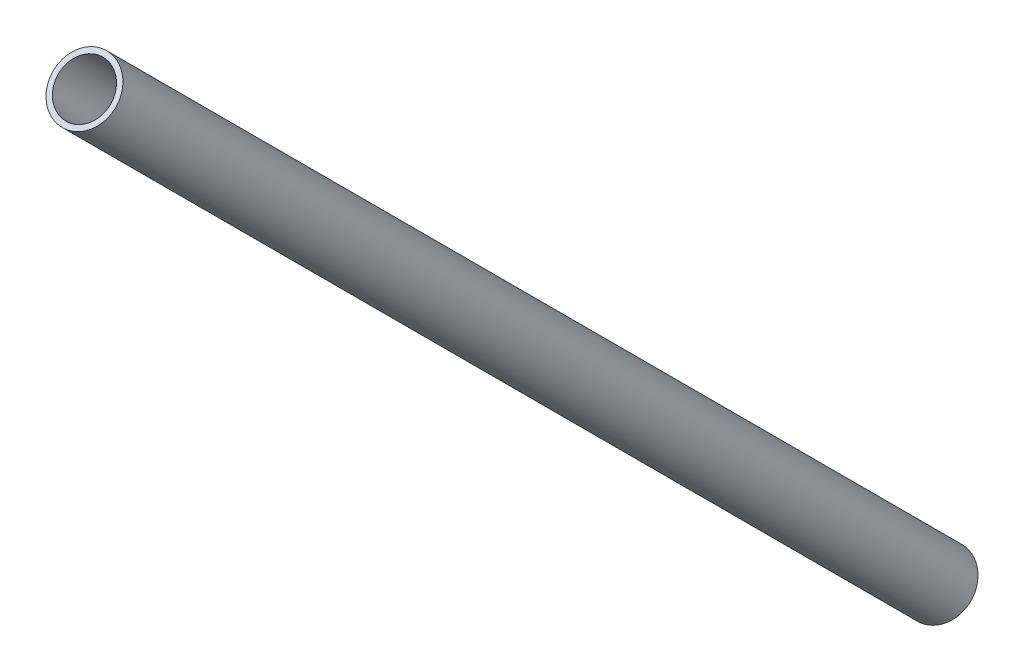
ISO-10303-21;
HEADER;
FILE_DESCRIPTION(('STEP AP214'),'2;1');
FILE_NAME('part.step','',(''),(''),'','','');
FILE_SCHEMA(('AUTOMOTIVE_DESIGN { 1 0 10303 214 1 1 1 1 }'));
ENDSEC;
DATA;
#1=APPLICATION_CONTEXT('core data for automotive mechanical design processes');
#2=APPLICATION_PROTOCOL_DEFINITION('international standard','automotive_design',2000,#1);
#3=PRODUCT_CONTEXT('',#1,'mechanical');
#4=PRODUCT('Part','Part','',(#3));
#5=PRODUCT_RELATED_PRODUCT_CATEGORY('part','',(#4));
#6=PRODUCT_DEFINITION_FORMATION('','',#4);
#7=PRODUCT_DEFINITION_CONTEXT('part definition',#1,'design');
#8=PRODUCT_DEFINITION('design','',#6,#7);
#9=PRODUCT_DEFINITION_SHAPE('','',#8);
#10=(LENGTH_UNIT() NAMED_UNIT(*) SI_UNIT(.MILLI.,.METRE.));
#11=(NAMED_UNIT(*) PLANE_ANGLE_UNIT() SI_UNIT($,.RADIAN.));
#12=(NAMED_UNIT(*) SI_UNIT($,.STERADIAN.) SOLID_ANGLE_UNIT());
#13=UNCERTAINTY_MEASURE_WITH_UNIT(LENGTH_MEASURE(1.E-05),#10,'distance_accuracy_value','');
#14=(GEOMETRIC_REPRESENTATION_CONTEXT(3) GLOBAL_UNCERTAINTY_ASSIGNED_CONTEXT((#13)) GLOBAL_UNIT_ASSIGNED_CONTEXT((#10,
#11,#12)) REPRESENTATION_CONTEXT('',''));
#15=CARTESIAN_POINT('',(0.,0.,0.));
#16=DIRECTION('',(0.,0.,1.));
#17=DIRECTION('',(1.,0.,0.));
#18=AXIS2_PLACEMENT_3D('',#15,#16,#17);
#19=CARTESIAN_POINT('',(0.,174.655374953078,166.170093578839));
#20=DIRECTION('',(0.,0.707106781186549,0.707106781186546));
#21=DIRECTION('',(0.,-0.707106781186546,0.707106781186549));
#22=AXIS2_PLACEMENT_3D('',#19,#20,#21);
#23=PLANE('',#22);
#24=CARTESIAN_POINT('',(0.,170.412734265958,170.412734265958));
#25=DIRECTION('',(0.,-0.707106781186549,-0.707106781186546));
#26=DIRECTION('',(0.,0.707106781186546,-0.707106781186549));
#27=AXIS2_PLACEMENT_3D('',#24,#25,#26);
#28=CIRCLE('',#27,5.00000000000002);
#29=CARTESIAN_POINT('',(0.,173.948268171891,166.877200360025));
#30=VERTEX_POINT('',#29);
#31=EDGE_CURVE('E10',#30,#30,#28,.T.);
#32=ORIENTED_EDGE('',*,*,#31,.T.);
#33=EDGE_LOOP('',(#32));
#34=FACE_BOUND('',#33,.T.);
#35=CARTESIAN_POINT('',(0.,170.412734265958,170.412734265958));
#36=DIRECTION('',(0.,-0.707106781186549,-0.707106781186546));
#37=DIRECTION('',(0.,0.707106781186546,-0.707106781186549));
#38=AXIS2_PLACEMENT_3D('',#35,#36,#37);
#39=CIRCLE('',#38,6.00000000000002);
#40=CARTESIAN_POINT('',(0.,174.655374953078,166.170093578839));
#41=VERTEX_POINT('',#40);
#42=EDGE_CURVE('E45',#41,#41,#39,.T.);
#43=ORIENTED_EDGE('',*,*,#42,.F.);
#44=EDGE_LOOP('',(#43));
#45=FACE_BOUND('',#44,.T.);
#46=ADVANCED_FACE('F31',(#34,#45),#23,.T.);
#47=CARTESIAN_POINT('',(0.,0.,0.));
#48=DIRECTION('',(0.,-0.707106781186549,-0.707106781186546));
#49=DIRECTION('',(0.,0.707106781186546,-0.707106781186549));
#50=AXIS2_PLACEMENT_3D('',#47,#48,#49);
#51=CYLINDRICAL_SURFACE('',#50,5.00000000000001);
#52=CARTESIAN_POINT('',(0.,7.07106781186547,7.07106781186544));
#53=DIRECTION('',(0.,-0.707106781186549,-0.707106781186546));
#54=DIRECTION('',(0.,0.707106781186546,-0.707106781186549));
#55=AXIS2_PLACEMENT_3D('',#52,#53,#54);
#56=CIRCLE('',#55,5.);
#57=CARTESIAN_POINT('',(0.,10.6066017177982,3.5355339059327));
#58=VERTEX_POINT('',#57);
#59=EDGE_CURVE('E37',#58,#58,#56,.T.);
#60=ORIENTED_EDGE('',*,*,#59,.T.);
#61=EDGE_LOOP('',(#60));
#62=FACE_BOUND('',#61,.T.);
#63=ORIENTED_EDGE('',*,*,#31,.F.);
#64=EDGE_LOOP('',(#63));
#65=FACE_BOUND('',#64,.T.);
#66=ADVANCED_FACE('F55',(#62,#65),#51,.F.);
#67=CARTESIAN_POINT('',(0.,11.3137084989848,2.82842712474616));
#68=DIRECTION('',(0.,-0.707106781186549,-0.707106781186546));
#69=DIRECTION('',(0.,0.707106781186546,-0.707106781186549));
#70=AXIS2_PLACEMENT_3D('',#67,#68,#69);
#71=PLANE('',#70);
#72=CARTESIAN_POINT('',(0.,7.07106781186549,7.07106781186546));
#73=DIRECTION('',(0.,-0.707106781186549,-0.707106781186546));
#74=DIRECTION('',(0.,0.707106781186546,-0.707106781186549));
#75=AXIS2_PLACEMENT_3D('',#72,#73,#74);
#76=CIRCLE('',#75,6.);
#77=CARTESIAN_POINT('',(0.,11.3137084989848,2.82842712474617));
#78=VERTEX_POINT('',#77);
#79=EDGE_CURVE('E41',#78,#78,#76,.T.);
#80=ORIENTED_EDGE('',*,*,#79,.T.);
#81=EDGE_LOOP('',(#80));
#82=FACE_BOUND('',#81,.T.);
#83=ORIENTED_EDGE('',*,*,#59,.F.);
#84=EDGE_LOOP('',(#83));
#85=FACE_BOUND('',#84,.T.);
#86=ADVANCED_FACE('F59',(#82,#85),#71,.T.);
#87=CARTESIAN_POINT('',(0.,0.,0.));
#88=DIRECTION('',(0.,-0.707106781186549,-0.707106781186546));
#89=DIRECTION('',(0.,0.707106781186546,-0.707106781186549));
#90=AXIS2_PLACEMENT_3D('',#87,#88,#89);
#91=CYLINDRICAL_SURFACE('',#90,6.00000000000001);
#92=ORIENTED_EDGE('',*,*,#42,.T.);
#93=EDGE_LOOP('',(#92));
#94=FACE_BOUND('',#93,.T.);
#95=ORIENTED_EDGE('',*,*,#79,.F.);
#96=EDGE_LOOP('',(#95));
#97=FACE_BOUND('',#96,.T.);
#98=ADVANCED_FACE('F51',(#94,#97),#91,.T.);
#99=CLOSED_SHELL('',(#46,#66,#86,#98));
#100=MANIFOLD_SOLID_BREP('B2',#99);
#101=ADVANCED_BREP_SHAPE_REPRESENTATION('',(#18,#100),#14);
#102=SHAPE_DEFINITION_REPRESENTATION(#9,#101);
ENDSEC;
END-ISO-10303-21;
